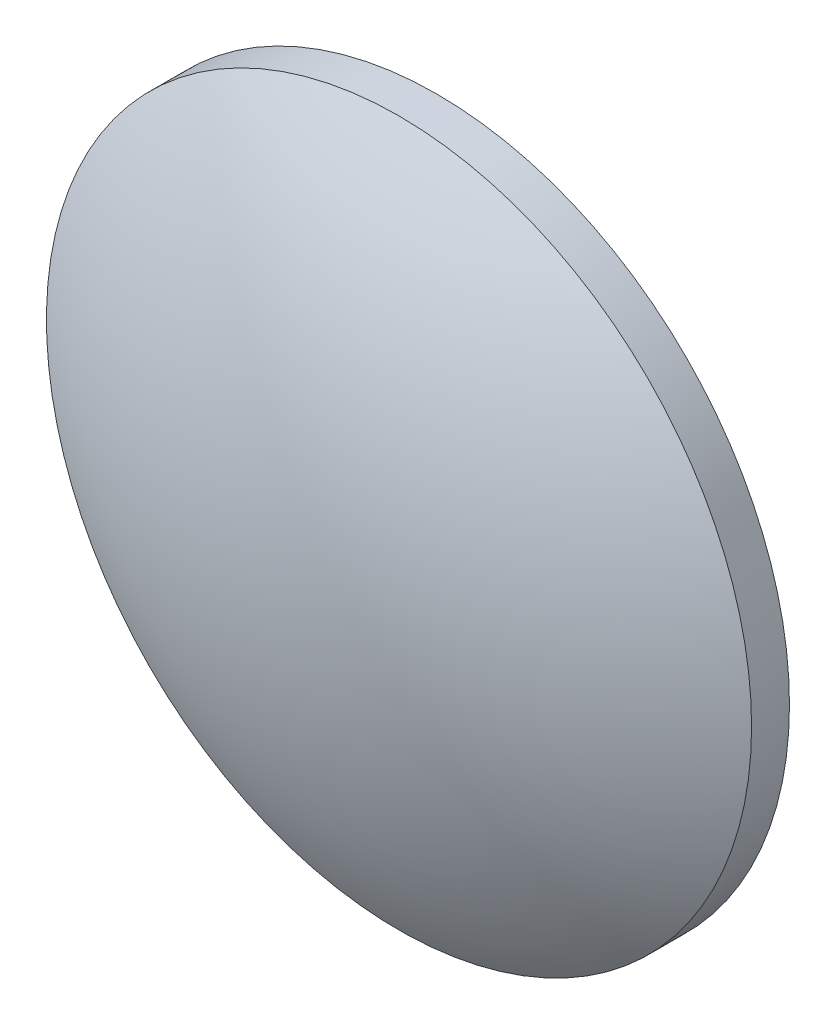
ISO-10303-21;
HEADER;
FILE_DESCRIPTION(('STEP AP214'),'2;1');
FILE_NAME('part.step','',(''),(''),'','','');
FILE_SCHEMA(('AUTOMOTIVE_DESIGN { 1 0 10303 214 1 1 1 1 }'));
ENDSEC;
DATA;
#1=APPLICATION_CONTEXT('core data for automotive mechanical design processes');
#2=APPLICATION_PROTOCOL_DEFINITION('international standard','automotive_design',2000,#1);
#3=PRODUCT_CONTEXT('',#1,'mechanical');
#4=PRODUCT('Part','Part','',(#3));
#5=PRODUCT_RELATED_PRODUCT_CATEGORY('part','',(#4));
#6=PRODUCT_DEFINITION_FORMATION('','',#4);
#7=PRODUCT_DEFINITION_CONTEXT('part definition',#1,'design');
#8=PRODUCT_DEFINITION('design','',#6,#7);
#9=PRODUCT_DEFINITION_SHAPE('','',#8);
#10=(LENGTH_UNIT() NAMED_UNIT(*) SI_UNIT(.MILLI.,.METRE.));
#11=(NAMED_UNIT(*) PLANE_ANGLE_UNIT() SI_UNIT($,.RADIAN.));
#12=(NAMED_UNIT(*) SI_UNIT($,.STERADIAN.) SOLID_ANGLE_UNIT());
#13=UNCERTAINTY_MEASURE_WITH_UNIT(LENGTH_MEASURE(1.E-05),#10,'distance_accuracy_value','');
#14=(GEOMETRIC_REPRESENTATION_CONTEXT(3) GLOBAL_UNCERTAINTY_ASSIGNED_CONTEXT((#13)) GLOBAL_UNIT_ASSIGNED_CONTEXT((#10,
#11,#12)) REPRESENTATION_CONTEXT('',''));
#15=CARTESIAN_POINT('',(0.,0.,0.));
#16=DIRECTION('',(0.,0.,1.));
#17=DIRECTION('',(1.,0.,0.));
#18=AXIS2_PLACEMENT_3D('',#15,#16,#17);
#19=CARTESIAN_POINT('',(0.,0.,-42.8575861495268));
#20=DIRECTION('',(0.,0.,1.));
#21=DIRECTION('',(0.,1.,0.));
#22=AXIS2_PLACEMENT_3D('',#19,#20,#21);
#23=SPHERICAL_SURFACE('',#22,47.87);
#24=CARTESIAN_POINT('',(0.,0.,-2.28201591323803));
#25=DIRECTION('',(0.,0.,1.));
#26=DIRECTION('',(1.,0.,0.));
#27=AXIS2_PLACEMENT_3D('',#24,#25,#26);
#28=CIRCLE('',#27,25.4);
#29=CARTESIAN_POINT('',(25.4,0.,-2.28201591323803));
#30=VERTEX_POINT('',#29);
#31=EDGE_CURVE('E8',#30,#30,#28,.T.);
#32=ORIENTED_EDGE('',*,*,#31,.T.);
#33=EDGE_LOOP('',(#32));
#34=FACE_BOUND('',#33,.T.);
#35=ADVANCED_FACE('F12',(#34),#23,.T.);
#36=CARTESIAN_POINT('',(0.,0.,10.2725176053143));
#37=DIRECTION('',(0.,0.,1.));
#38=DIRECTION('',(1.,0.,0.));
#39=AXIS2_PLACEMENT_3D('',#36,#37,#38);
#40=CYLINDRICAL_SURFACE('',#39,25.4);
#41=ORIENTED_EDGE('',*,*,#31,.F.);
#42=EDGE_LOOP('',(#41));
#43=FACE_BOUND('',#42,.T.);
#44=CARTESIAN_POINT('',(0.,0.,-5.01241385047323));
#45=DIRECTION('',(0.,0.,1.));
#46=DIRECTION('',(1.,0.,0.));
#47=AXIS2_PLACEMENT_3D('',#44,#45,#46);
#48=CIRCLE('',#47,25.4);
#49=CARTESIAN_POINT('',(25.4,0.,-5.01241385047323));
#50=VERTEX_POINT('',#49);
#51=EDGE_CURVE('E18',#50,#50,#48,.T.);
#52=ORIENTED_EDGE('',*,*,#51,.T.);
#53=EDGE_LOOP('',(#52));
#54=FACE_BOUND('',#53,.T.);
#55=ADVANCED_FACE('F24',(#43,#54),#40,.T.);
#56=CARTESIAN_POINT('',(0.,0.,-121.597586149527));
#57=DIRECTION('',(0.,0.,1.));
#58=DIRECTION('',(0.,1.,0.));
#59=AXIS2_PLACEMENT_3D('',#56,#57,#58);
#60=SPHERICAL_SURFACE('',#59,119.32);
#61=ORIENTED_EDGE('',*,*,#51,.F.);
#62=EDGE_LOOP('',(#61));
#63=FACE_BOUND('',#62,.T.);
#64=ADVANCED_FACE('F26',(#63),#60,.F.);
#65=CLOSED_SHELL('',(#35,#55,#64));
#66=MANIFOLD_SOLID_BREP('B1',#65);
#67=ADVANCED_BREP_SHAPE_REPRESENTATION('',(#18,#66),#14);
#68=SHAPE_DEFINITION_REPRESENTATION(#9,#67);
ENDSEC;
END-ISO-10303-21;
